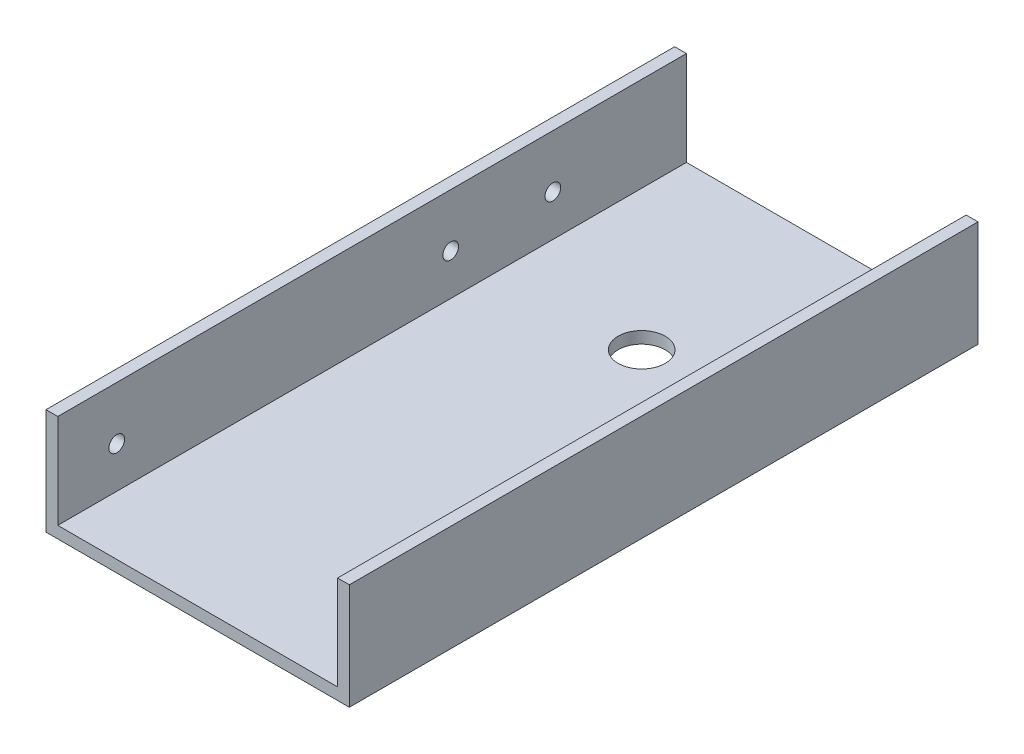
ISO-10303-21;
HEADER;
FILE_DESCRIPTION(('STEP AP214'),'2;1');
FILE_NAME('part.step','',(''),(''),'','','');
FILE_SCHEMA(('AUTOMOTIVE_DESIGN { 1 0 10303 214 1 1 1 1 }'));
ENDSEC;
DATA;
#1=APPLICATION_CONTEXT('core data for automotive mechanical design processes');
#2=APPLICATION_PROTOCOL_DEFINITION('international standard','automotive_design',2000,#1);
#3=PRODUCT_CONTEXT('',#1,'mechanical');
#4=PRODUCT('Part','Part','',(#3));
#5=PRODUCT_RELATED_PRODUCT_CATEGORY('part','',(#4));
#6=PRODUCT_DEFINITION_FORMATION('','',#4);
#7=PRODUCT_DEFINITION_CONTEXT('part definition',#1,'design');
#8=PRODUCT_DEFINITION('design','',#6,#7);
#9=PRODUCT_DEFINITION_SHAPE('','',#8);
#10=(LENGTH_UNIT() NAMED_UNIT(*) SI_UNIT(.MILLI.,.METRE.));
#11=(NAMED_UNIT(*) PLANE_ANGLE_UNIT() SI_UNIT($,.RADIAN.));
#12=(NAMED_UNIT(*) SI_UNIT($,.STERADIAN.) SOLID_ANGLE_UNIT());
#13=UNCERTAINTY_MEASURE_WITH_UNIT(LENGTH_MEASURE(1.E-05),#10,'distance_accuracy_value','');
#14=(GEOMETRIC_REPRESENTATION_CONTEXT(3) GLOBAL_UNCERTAINTY_ASSIGNED_CONTEXT((#13)) GLOBAL_UNIT_ASSIGNED_CONTEXT((#10,
#11,#12)) REPRESENTATION_CONTEXT('',''));
#15=CARTESIAN_POINT('',(0.,0.,0.));
#16=DIRECTION('',(0.,0.,1.));
#17=DIRECTION('',(1.,0.,0.));
#18=AXIS2_PLACEMENT_3D('',#15,#16,#17);
#19=CARTESIAN_POINT('',(-19.3,13.5,40.));
#20=DIRECTION('',(0.,-1.,0.));
#21=DIRECTION('',(0.,0.,-1.));
#22=AXIS2_PLACEMENT_3D('',#19,#20,#21);
#23=PLANE('',#22);
#24=DIRECTION('',(-1.,0.,0.));
#25=VECTOR('',#24,1.);
#26=CARTESIAN_POINT('',(-19.3,13.5,-40.));
#27=LINE('',#26,#25);
#28=CARTESIAN_POINT('',(-17.8,13.5,-40.));
#29=VERTEX_POINT('',#28);
#30=CARTESIAN_POINT('',(-19.3,13.5,-40.));
#31=VERTEX_POINT('',#30);
#32=EDGE_CURVE('E112',#29,#31,#27,.T.);
#33=ORIENTED_EDGE('',*,*,#32,.T.);
#34=DIRECTION('',(0.,0.,-1.));
#35=VECTOR('',#34,1.);
#36=CARTESIAN_POINT('',(-19.3,13.5,40.));
#37=LINE('',#36,#35);
#38=CARTESIAN_POINT('',(-19.3,13.5,40.));
#39=VERTEX_POINT('',#38);
#40=EDGE_CURVE('E23',#39,#31,#37,.T.);
#41=ORIENTED_EDGE('',*,*,#40,.F.);
#42=DIRECTION('',(-1.,0.,0.));
#43=VECTOR('',#42,1.);
#44=CARTESIAN_POINT('',(-19.3,13.5,40.));
#45=LINE('',#44,#43);
#46=CARTESIAN_POINT('',(-17.8,13.5,40.));
#47=VERTEX_POINT('',#46);
#48=EDGE_CURVE('E127',#47,#39,#45,.T.);
#49=ORIENTED_EDGE('',*,*,#48,.F.);
#50=DIRECTION('',(0.,0.,-1.));
#51=VECTOR('',#50,1.);
#52=CARTESIAN_POINT('',(-17.8,13.5,40.));
#53=LINE('',#52,#51);
#54=EDGE_CURVE('E108',#47,#29,#53,.T.);
#55=ORIENTED_EDGE('',*,*,#54,.T.);
#56=EDGE_LOOP('',(#33,#41,#49,#55));
#57=FACE_BOUND('',#56,.T.);
#58=ADVANCED_FACE('F15',(#57),#23,.F.);
#59=CARTESIAN_POINT('',(-19.3,13.5,40.));
#60=DIRECTION('',(1.,0.,0.));
#61=DIRECTION('',(0.,1.,0.));
#62=AXIS2_PLACEMENT_3D('',#59,#60,#61);
#63=PLANE('',#62);
#64=CARTESIAN_POINT('',(-19.3,6.75,32.5));
#65=DIRECTION('',(-1.,0.,0.));
#66=DIRECTION('',(0.,-1.,0.));
#67=AXIS2_PLACEMENT_3D('',#64,#65,#66);
#68=CIRCLE('',#67,1.);
#69=CARTESIAN_POINT('',(-19.3,5.75,32.5));
#70=VERTEX_POINT('',#69);
#71=EDGE_CURVE('E337',#70,#70,#68,.T.);
#72=ORIENTED_EDGE('',*,*,#71,.F.);
#73=EDGE_LOOP('',(#72));
#74=FACE_BOUND('',#73,.T.);
#75=CARTESIAN_POINT('',(-19.3,6.75,-10.));
#76=DIRECTION('',(-1.,0.,0.));
#77=DIRECTION('',(0.,-1.,0.));
#78=AXIS2_PLACEMENT_3D('',#75,#76,#77);
#79=CIRCLE('',#78,1.);
#80=CARTESIAN_POINT('',(-19.3,5.75,-10.));
#81=VERTEX_POINT('',#80);
#82=EDGE_CURVE('E345',#81,#81,#79,.T.);
#83=ORIENTED_EDGE('',*,*,#82,.F.);
#84=EDGE_LOOP('',(#83));
#85=FACE_BOUND('',#84,.T.);
#86=CARTESIAN_POINT('',(-19.3,6.75,-23.));
#87=DIRECTION('',(-1.,0.,0.));
#88=DIRECTION('',(0.,-1.,0.));
#89=AXIS2_PLACEMENT_3D('',#86,#87,#88);
#90=CIRCLE('',#89,1.);
#91=CARTESIAN_POINT('',(-19.3,5.75,-23.));
#92=VERTEX_POINT('',#91);
#93=EDGE_CURVE('E145',#92,#92,#90,.T.);
#94=ORIENTED_EDGE('',*,*,#93,.F.);
#95=EDGE_LOOP('',(#94));
#96=FACE_BOUND('',#95,.T.);
#97=DIRECTION('',(0.,-1.,0.));
#98=VECTOR('',#97,1.);
#99=CARTESIAN_POINT('',(-19.3,13.5,-40.));
#100=LINE('',#99,#98);
#101=CARTESIAN_POINT('',(-19.3,0.,-40.));
#102=VERTEX_POINT('',#101);
#103=EDGE_CURVE('E115',#31,#102,#100,.T.);
#104=ORIENTED_EDGE('',*,*,#103,.T.);
#105=DIRECTION('',(0.,0.,-1.));
#106=VECTOR('',#105,1.);
#107=CARTESIAN_POINT('',(-19.3,0.,40.));
#108=LINE('',#107,#106);
#109=CARTESIAN_POINT('',(-19.3,0.,40.));
#110=VERTEX_POINT('',#109);
#111=EDGE_CURVE('E137',#110,#102,#108,.T.);
#112=ORIENTED_EDGE('',*,*,#111,.F.);
#113=DIRECTION('',(0.,-1.,0.));
#114=VECTOR('',#113,1.);
#115=CARTESIAN_POINT('',(-19.3,13.5,40.));
#116=LINE('',#115,#114);
#117=EDGE_CURVE('E75',#39,#110,#116,.T.);
#118=ORIENTED_EDGE('',*,*,#117,.F.);
#119=ORIENTED_EDGE('',*,*,#40,.T.);
#120=EDGE_LOOP('',(#104,#112,#118,#119));
#121=FACE_BOUND('',#120,.T.);
#122=ADVANCED_FACE('F192',(#74,#85,#96,#121),#63,.F.);
#123=CARTESIAN_POINT('',(-19.3,0.,40.));
#124=DIRECTION('',(0.,1.,0.));
#125=DIRECTION('',(0.,0.,1.));
#126=AXIS2_PLACEMENT_3D('',#123,#124,#125);
#127=PLANE('',#126);
#128=CARTESIAN_POINT('',(0.,0.,16.5));
#129=DIRECTION('',(0.,1.,0.));
#130=DIRECTION('',(0.,0.,1.));
#131=AXIS2_PLACEMENT_3D('',#128,#129,#130);
#132=CIRCLE('',#131,2.85);
#133=CARTESIAN_POINT('',(0.,0.,19.35));
#134=VERTEX_POINT('',#133);
#135=EDGE_CURVE('E10',#134,#134,#132,.F.);
#136=ORIENTED_EDGE('',*,*,#135,.F.);
#137=EDGE_LOOP('',(#136));
#138=FACE_BOUND('',#137,.T.);
#139=CARTESIAN_POINT('',(0.,0.,-16.5));
#140=DIRECTION('',(0.,-1.,0.));
#141=DIRECTION('',(0.,0.,-1.));
#142=AXIS2_PLACEMENT_3D('',#139,#140,#141);
#143=CIRCLE('',#142,3.);
#144=CARTESIAN_POINT('',(0.,0.,-19.5));
#145=VERTEX_POINT('',#144);
#146=EDGE_CURVE('E141',#145,#145,#143,.T.);
#147=ORIENTED_EDGE('',*,*,#146,.F.);
#148=EDGE_LOOP('',(#147));
#149=FACE_BOUND('',#148,.T.);
#150=DIRECTION('',(1.,0.,0.));
#151=VECTOR('',#150,1.);
#152=CARTESIAN_POINT('',(-19.3,0.,-40.));
#153=LINE('',#152,#151);
#154=CARTESIAN_POINT('',(19.3,0.,-40.));
#155=VERTEX_POINT('',#154);
#156=EDGE_CURVE('E118',#102,#155,#153,.T.);
#157=ORIENTED_EDGE('',*,*,#156,.T.);
#158=DIRECTION('',(0.,0.,-1.));
#159=VECTOR('',#158,1.);
#160=CARTESIAN_POINT('',(19.3,0.,40.));
#161=LINE('',#160,#159);
#162=CARTESIAN_POINT('',(19.3,0.,40.));
#163=VERTEX_POINT('',#162);
#164=EDGE_CURVE('E134',#163,#155,#161,.T.);
#165=ORIENTED_EDGE('',*,*,#164,.F.);
#166=DIRECTION('',(1.,0.,0.));
#167=VECTOR('',#166,1.);
#168=CARTESIAN_POINT('',(-19.3,0.,40.));
#169=LINE('',#168,#167);
#170=EDGE_CURVE('E156',#110,#163,#169,.T.);
#171=ORIENTED_EDGE('',*,*,#170,.F.);
#172=ORIENTED_EDGE('',*,*,#111,.T.);
#173=EDGE_LOOP('',(#157,#165,#171,#172));
#174=FACE_BOUND('',#173,.T.);
#175=ADVANCED_FACE('F197',(#138,#149,#174),#127,.F.);
#176=CARTESIAN_POINT('',(19.3,0.,40.));
#177=DIRECTION('',(-1.,0.,0.));
#178=DIRECTION('',(0.,-1.,0.));
#179=AXIS2_PLACEMENT_3D('',#176,#177,#178);
#180=PLANE('',#179);
#181=DIRECTION('',(0.,1.,0.));
#182=VECTOR('',#181,1.);
#183=CARTESIAN_POINT('',(19.3,0.,-40.));
#184=LINE('',#183,#182);
#185=CARTESIAN_POINT('',(19.3,13.5,-40.));
#186=VERTEX_POINT('',#185);
#187=EDGE_CURVE('E120',#155,#186,#184,.T.);
#188=ORIENTED_EDGE('',*,*,#187,.T.);
#189=DIRECTION('',(0.,0.,-1.));
#190=VECTOR('',#189,1.);
#191=CARTESIAN_POINT('',(19.3,13.5,40.));
#192=LINE('',#191,#190);
#193=CARTESIAN_POINT('',(19.3,13.5,40.));
#194=VERTEX_POINT('',#193);
#195=EDGE_CURVE('E131',#194,#186,#192,.T.);
#196=ORIENTED_EDGE('',*,*,#195,.F.);
#197=DIRECTION('',(0.,1.,0.));
#198=VECTOR('',#197,1.);
#199=CARTESIAN_POINT('',(19.3,0.,40.));
#200=LINE('',#199,#198);
#201=EDGE_CURVE('E158',#163,#194,#200,.T.);
#202=ORIENTED_EDGE('',*,*,#201,.F.);
#203=ORIENTED_EDGE('',*,*,#164,.T.);
#204=EDGE_LOOP('',(#188,#196,#202,#203));
#205=FACE_BOUND('',#204,.T.);
#206=ADVANCED_FACE('F164',(#205),#180,.F.);
#207=CARTESIAN_POINT('',(17.8,13.5,40.));
#208=DIRECTION('',(0.,-1.,0.));
#209=DIRECTION('',(0.,0.,-1.));
#210=AXIS2_PLACEMENT_3D('',#207,#208,#209);
#211=PLANE('',#210);
#212=DIRECTION('',(-1.,0.,0.));
#213=VECTOR('',#212,1.);
#214=CARTESIAN_POINT('',(17.8,13.5,-40.));
#215=LINE('',#214,#213);
#216=CARTESIAN_POINT('',(17.8,13.5,-40.));
#217=VERTEX_POINT('',#216);
#218=EDGE_CURVE('E122',#186,#217,#215,.T.);
#219=ORIENTED_EDGE('',*,*,#218,.T.);
#220=DIRECTION('',(0.,0.,-1.));
#221=VECTOR('',#220,1.);
#222=CARTESIAN_POINT('',(17.8,13.5,40.));
#223=LINE('',#222,#221);
#224=CARTESIAN_POINT('',(17.8,13.5,40.));
#225=VERTEX_POINT('',#224);
#226=EDGE_CURVE('E103',#225,#217,#223,.T.);
#227=ORIENTED_EDGE('',*,*,#226,.F.);
#228=DIRECTION('',(-1.,0.,0.));
#229=VECTOR('',#228,1.);
#230=CARTESIAN_POINT('',(17.8,13.5,40.));
#231=LINE('',#230,#229);
#232=EDGE_CURVE('E94',#194,#225,#231,.T.);
#233=ORIENTED_EDGE('',*,*,#232,.F.);
#234=ORIENTED_EDGE('',*,*,#195,.T.);
#235=EDGE_LOOP('',(#219,#227,#233,#234));
#236=FACE_BOUND('',#235,.T.);
#237=ADVANCED_FACE('F168',(#236),#211,.F.);
#238=CARTESIAN_POINT('',(17.8,1.5,40.));
#239=DIRECTION('',(1.,0.,0.));
#240=DIRECTION('',(0.,0.,-1.));
#241=AXIS2_PLACEMENT_3D('',#238,#239,#240);
#242=PLANE('',#241);
#243=DIRECTION('',(0.,-1.,0.));
#244=VECTOR('',#243,1.);
#245=CARTESIAN_POINT('',(17.8,1.5,-40.));
#246=LINE('',#245,#244);
#247=CARTESIAN_POINT('',(17.8,1.5,-40.));
#248=VERTEX_POINT('',#247);
#249=EDGE_CURVE('E102',#217,#248,#246,.T.);
#250=ORIENTED_EDGE('',*,*,#249,.T.);
#251=DIRECTION('',(0.,0.,-1.));
#252=VECTOR('',#251,1.);
#253=CARTESIAN_POINT('',(17.8,1.5,40.));
#254=LINE('',#253,#252);
#255=CARTESIAN_POINT('',(17.8,1.5,40.));
#256=VERTEX_POINT('',#255);
#257=EDGE_CURVE('E99',#256,#248,#254,.T.);
#258=ORIENTED_EDGE('',*,*,#257,.F.);
#259=DIRECTION('',(0.,-1.,0.));
#260=VECTOR('',#259,1.);
#261=CARTESIAN_POINT('',(17.8,1.5,40.));
#262=LINE('',#261,#260);
#263=EDGE_CURVE('E88',#225,#256,#262,.T.);
#264=ORIENTED_EDGE('',*,*,#263,.F.);
#265=ORIENTED_EDGE('',*,*,#226,.T.);
#266=EDGE_LOOP('',(#250,#258,#264,#265));
#267=FACE_BOUND('',#266,.T.);
#268=ADVANCED_FACE('F100',(#267),#242,.F.);
#269=CARTESIAN_POINT('',(-17.8,1.5,40.));
#270=DIRECTION('',(0.,-1.,0.));
#271=DIRECTION('',(0.,0.,-1.));
#272=AXIS2_PLACEMENT_3D('',#269,#270,#271);
#273=PLANE('',#272);
#274=CARTESIAN_POINT('',(0.,1.5,-16.5));
#275=DIRECTION('',(0.,-1.,0.));
#276=DIRECTION('',(0.,0.,-1.));
#277=AXIS2_PLACEMENT_3D('',#274,#275,#276);
#278=CIRCLE('',#277,3.);
#279=CARTESIAN_POINT('',(0.,1.5,-19.5));
#280=VERTEX_POINT('',#279);
#281=EDGE_CURVE('E116',#280,#280,#278,.T.);
#282=ORIENTED_EDGE('',*,*,#281,.T.);
#283=EDGE_LOOP('',(#282));
#284=FACE_BOUND('',#283,.T.);
#285=DIRECTION('',(-1.,0.,0.));
#286=VECTOR('',#285,1.);
#287=CARTESIAN_POINT('',(-17.8,1.5,-40.));
#288=LINE('',#287,#286);
#289=CARTESIAN_POINT('',(-17.8,1.5,-40.));
#290=VERTEX_POINT('',#289);
#291=EDGE_CURVE('E60',#248,#290,#288,.T.);
#292=ORIENTED_EDGE('',*,*,#291,.T.);
#293=DIRECTION('',(0.,0.,-1.));
#294=VECTOR('',#293,1.);
#295=CARTESIAN_POINT('',(-17.8,1.5,40.));
#296=LINE('',#295,#294);
#297=CARTESIAN_POINT('',(-17.8,1.5,40.));
#298=VERTEX_POINT('',#297);
#299=EDGE_CURVE('E104',#298,#290,#296,.T.);
#300=ORIENTED_EDGE('',*,*,#299,.F.);
#301=DIRECTION('',(-1.,0.,0.));
#302=VECTOR('',#301,1.);
#303=CARTESIAN_POINT('',(-17.8,1.5,40.));
#304=LINE('',#303,#302);
#305=EDGE_CURVE('E92',#256,#298,#304,.T.);
#306=ORIENTED_EDGE('',*,*,#305,.F.);
#307=ORIENTED_EDGE('',*,*,#257,.T.);
#308=EDGE_LOOP('',(#292,#300,#306,#307));
#309=FACE_BOUND('',#308,.T.);
#310=ADVANCED_FACE('F106',(#284,#309),#273,.F.);
#311=CARTESIAN_POINT('',(-17.8,13.5,40.));
#312=DIRECTION('',(-1.,0.,0.));
#313=DIRECTION('',(0.,0.,1.));
#314=AXIS2_PLACEMENT_3D('',#311,#312,#313);
#315=PLANE('',#314);
#316=CARTESIAN_POINT('',(-17.8,6.75,32.5));
#317=DIRECTION('',(-1.,0.,0.));
#318=DIRECTION('',(0.,0.,1.));
#319=AXIS2_PLACEMENT_3D('',#316,#317,#318);
#320=CIRCLE('',#319,1.);
#321=CARTESIAN_POINT('',(-17.8,6.75,33.5));
#322=VERTEX_POINT('',#321);
#323=EDGE_CURVE('E334',#322,#322,#320,.F.);
#324=ORIENTED_EDGE('',*,*,#323,.F.);
#325=EDGE_LOOP('',(#324));
#326=FACE_BOUND('',#325,.T.);
#327=CARTESIAN_POINT('',(-17.8,6.75,-10.));
#328=DIRECTION('',(-1.,0.,0.));
#329=DIRECTION('',(0.,0.,1.));
#330=AXIS2_PLACEMENT_3D('',#327,#328,#329);
#331=CIRCLE('',#330,1.);
#332=CARTESIAN_POINT('',(-17.8,6.75,-9.));
#333=VERTEX_POINT('',#332);
#334=EDGE_CURVE('E342',#333,#333,#331,.F.);
#335=ORIENTED_EDGE('',*,*,#334,.F.);
#336=EDGE_LOOP('',(#335));
#337=FACE_BOUND('',#336,.T.);
#338=CARTESIAN_POINT('',(-17.8,6.75,-23.));
#339=DIRECTION('',(-1.,0.,0.));
#340=DIRECTION('',(0.,0.,1.));
#341=AXIS2_PLACEMENT_3D('',#338,#339,#340);
#342=CIRCLE('',#341,1.);
#343=CARTESIAN_POINT('',(-17.8,6.75,-22.));
#344=VERTEX_POINT('',#343);
#345=EDGE_CURVE('E150',#344,#344,#342,.F.);
#346=ORIENTED_EDGE('',*,*,#345,.F.);
#347=EDGE_LOOP('',(#346));
#348=FACE_BOUND('',#347,.T.);
#349=DIRECTION('',(0.,1.,0.));
#350=VECTOR('',#349,1.);
#351=CARTESIAN_POINT('',(-17.8,13.5,-40.));
#352=LINE('',#351,#350);
#353=EDGE_CURVE('E66',#290,#29,#352,.T.);
#354=ORIENTED_EDGE('',*,*,#353,.T.);
#355=ORIENTED_EDGE('',*,*,#54,.F.);
#356=DIRECTION('',(0.,1.,0.));
#357=VECTOR('',#356,1.);
#358=CARTESIAN_POINT('',(-17.8,13.5,40.));
#359=LINE('',#358,#357);
#360=EDGE_CURVE('E31',#298,#47,#359,.T.);
#361=ORIENTED_EDGE('',*,*,#360,.F.);
#362=ORIENTED_EDGE('',*,*,#299,.T.);
#363=EDGE_LOOP('',(#354,#355,#361,#362));
#364=FACE_BOUND('',#363,.T.);
#365=ADVANCED_FACE('F176',(#326,#337,#348,#364),#315,.F.);
#366=CARTESIAN_POINT('',(0.,0.,40.));
#367=DIRECTION('',(0.,0.,-1.));
#368=DIRECTION('',(-1.,0.,0.));
#369=AXIS2_PLACEMENT_3D('',#366,#367,#368);
#370=PLANE('',#369);
#371=ORIENTED_EDGE('',*,*,#48,.T.);
#372=ORIENTED_EDGE('',*,*,#117,.T.);
#373=ORIENTED_EDGE('',*,*,#170,.T.);
#374=ORIENTED_EDGE('',*,*,#201,.T.);
#375=ORIENTED_EDGE('',*,*,#232,.T.);
#376=ORIENTED_EDGE('',*,*,#263,.T.);
#377=ORIENTED_EDGE('',*,*,#305,.T.);
#378=ORIENTED_EDGE('',*,*,#360,.T.);
#379=EDGE_LOOP('',(#371,#372,#373,#374,#375,#376,#377,#378));
#380=FACE_BOUND('',#379,.T.);
#381=ADVANCED_FACE('F90',(#380),#370,.F.);
#382=CARTESIAN_POINT('',(0.,0.,-40.));
#383=DIRECTION('',(0.,0.,-1.));
#384=DIRECTION('',(-1.,0.,0.));
#385=AXIS2_PLACEMENT_3D('',#382,#383,#384);
#386=PLANE('',#385);
#387=ORIENTED_EDGE('',*,*,#32,.F.);
#388=ORIENTED_EDGE('',*,*,#353,.F.);
#389=ORIENTED_EDGE('',*,*,#291,.F.);
#390=ORIENTED_EDGE('',*,*,#249,.F.);
#391=ORIENTED_EDGE('',*,*,#218,.F.);
#392=ORIENTED_EDGE('',*,*,#187,.F.);
#393=ORIENTED_EDGE('',*,*,#156,.F.);
#394=ORIENTED_EDGE('',*,*,#103,.F.);
#395=EDGE_LOOP('',(#387,#388,#389,#390,#391,#392,#393,#394));
#396=FACE_BOUND('',#395,.T.);
#397=ADVANCED_FACE('F171',(#396),#386,.T.);
#398=CARTESIAN_POINT('',(0.,13.5,-16.5));
#399=DIRECTION('',(0.,-1.,0.));
#400=DIRECTION('',(0.,0.,-1.));
#401=AXIS2_PLACEMENT_3D('',#398,#399,#400);
#402=CYLINDRICAL_SURFACE('',#401,3.);
#403=ORIENTED_EDGE('',*,*,#146,.T.);
#404=EDGE_LOOP('',(#403));
#405=FACE_BOUND('',#404,.T.);
#406=ORIENTED_EDGE('',*,*,#281,.F.);
#407=EDGE_LOOP('',(#406));
#408=FACE_BOUND('',#407,.T.);
#409=ADVANCED_FACE('F272',(#405,#408),#402,.F.);
#410=CARTESIAN_POINT('',(19.301,6.75,-23.));
#411=DIRECTION('',(-1.,0.,0.));
#412=DIRECTION('',(0.,-1.,0.));
#413=AXIS2_PLACEMENT_3D('',#410,#411,#412);
#414=CYLINDRICAL_SURFACE('',#413,1.);
#415=ORIENTED_EDGE('',*,*,#93,.T.);
#416=EDGE_LOOP('',(#415));
#417=FACE_BOUND('',#416,.T.);
#418=ORIENTED_EDGE('',*,*,#345,.T.);
#419=EDGE_LOOP('',(#418));
#420=FACE_BOUND('',#419,.T.);
#421=ADVANCED_FACE('F278',(#417,#420),#414,.F.);
#422=CARTESIAN_POINT('',(19.301,6.75,-10.));
#423=DIRECTION('',(-1.,0.,0.));
#424=DIRECTION('',(0.,-1.,0.));
#425=AXIS2_PLACEMENT_3D('',#422,#423,#424);
#426=CYLINDRICAL_SURFACE('',#425,1.);
#427=ORIENTED_EDGE('',*,*,#82,.T.);
#428=EDGE_LOOP('',(#427));
#429=FACE_BOUND('',#428,.T.);
#430=ORIENTED_EDGE('',*,*,#334,.T.);
#431=EDGE_LOOP('',(#430));
#432=FACE_BOUND('',#431,.T.);
#433=ADVANCED_FACE('F286',(#429,#432),#426,.F.);
#434=CARTESIAN_POINT('',(19.301,6.75,32.5));
#435=DIRECTION('',(-1.,0.,0.));
#436=DIRECTION('',(0.,-1.,0.));
#437=AXIS2_PLACEMENT_3D('',#434,#435,#436);
#438=CYLINDRICAL_SURFACE('',#437,1.);
#439=ORIENTED_EDGE('',*,*,#71,.T.);
#440=EDGE_LOOP('',(#439));
#441=FACE_BOUND('',#440,.T.);
#442=ORIENTED_EDGE('',*,*,#323,.T.);
#443=EDGE_LOOP('',(#442));
#444=FACE_BOUND('',#443,.T.);
#445=ADVANCED_FACE('F295',(#441,#444),#438,.F.);
#446=CARTESIAN_POINT('',(0.,-3.5,16.5));
#447=DIRECTION('',(0.,1.,0.));
#448=DIRECTION('',(0.,0.,1.));
#449=AXIS2_PLACEMENT_3D('',#446,#447,#448);
#450=CYLINDRICAL_SURFACE('',#449,2.85);
#451=CARTESIAN_POINT('',(0.,-3.5,16.5));
#452=DIRECTION('',(0.,-1.,0.));
#453=DIRECTION('',(0.,0.,-1.));
#454=AXIS2_PLACEMENT_3D('',#451,#452,#453);
#455=CIRCLE('',#454,2.85);
#456=CARTESIAN_POINT('',(0.,-3.5,13.65));
#457=VERTEX_POINT('',#456);
#458=EDGE_CURVE('E333',#457,#457,#455,.T.);
#459=ORIENTED_EDGE('',*,*,#458,.F.);
#460=EDGE_LOOP('',(#459));
#461=FACE_BOUND('',#460,.T.);
#462=ORIENTED_EDGE('',*,*,#135,.T.);
#463=EDGE_LOOP('',(#462));
#464=FACE_BOUND('',#463,.T.);
#465=ADVANCED_FACE('F304',(#461,#464),#450,.T.);
#466=CARTESIAN_POINT('',(0.,-3.5,16.5));
#467=DIRECTION('',(0.,-1.,0.));
#468=DIRECTION('',(0.,0.,-1.));
#469=AXIS2_PLACEMENT_3D('',#466,#467,#468);
#470=PLANE('',#469);
#471=ORIENTED_EDGE('',*,*,#458,.T.);
#472=EDGE_LOOP('',(#471));
#473=FACE_BOUND('',#472,.T.);
#474=ADVANCED_FACE('F313',(#473),#470,.T.);
#475=CLOSED_SHELL('',(#58,#122,#175,#206,#237,#268,#310,#365,#381,#397,#409,#421,#433,#445,#465,#474));
#476=MANIFOLD_SOLID_BREP('B1',#475);
#477=ADVANCED_BREP_SHAPE_REPRESENTATION('',(#18,#476),#14);
#478=SHAPE_DEFINITION_REPRESENTATION(#9,#477);
ENDSEC;
END-ISO-10303-21;
